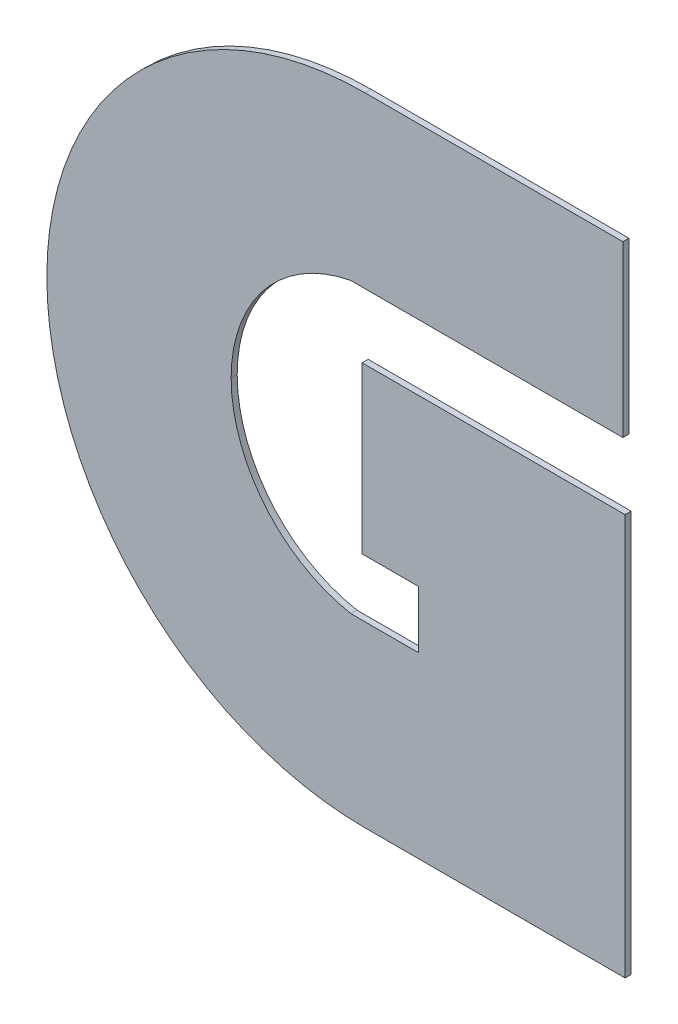
ISO-10303-21;
HEADER;
FILE_DESCRIPTION(('STEP AP214'),'2;1');
FILE_NAME('part.step','',(''),(''),'','','');
FILE_SCHEMA(('AUTOMOTIVE_DESIGN { 1 0 10303 214 1 1 1 1 }'));
ENDSEC;
DATA;
#1=APPLICATION_CONTEXT('core data for automotive mechanical design processes');
#2=APPLICATION_PROTOCOL_DEFINITION('international standard','automotive_design',2000,#1);
#3=PRODUCT_CONTEXT('',#1,'mechanical');
#4=PRODUCT('Part','Part','',(#3));
#5=PRODUCT_RELATED_PRODUCT_CATEGORY('part','',(#4));
#6=PRODUCT_DEFINITION_FORMATION('','',#4);
#7=PRODUCT_DEFINITION_CONTEXT('part definition',#1,'design');
#8=PRODUCT_DEFINITION('design','',#6,#7);
#9=PRODUCT_DEFINITION_SHAPE('','',#8);
#10=(LENGTH_UNIT() NAMED_UNIT(*) SI_UNIT(.MILLI.,.METRE.));
#11=(NAMED_UNIT(*) PLANE_ANGLE_UNIT() SI_UNIT($,.RADIAN.));
#12=(NAMED_UNIT(*) SI_UNIT($,.STERADIAN.) SOLID_ANGLE_UNIT());
#13=UNCERTAINTY_MEASURE_WITH_UNIT(LENGTH_MEASURE(1.E-05),#10,'distance_accuracy_value','');
#14=(GEOMETRIC_REPRESENTATION_CONTEXT(3) GLOBAL_UNCERTAINTY_ASSIGNED_CONTEXT((#13)) GLOBAL_UNIT_ASSIGNED_CONTEXT((#10,
#11,#12)) REPRESENTATION_CONTEXT('',''));
#15=CARTESIAN_POINT('',(0.,0.,0.));
#16=DIRECTION('',(0.,0.,1.));
#17=DIRECTION('',(1.,0.,0.));
#18=AXIS2_PLACEMENT_3D('',#15,#16,#17);
#19=CARTESIAN_POINT('',(1.17538503979784,1.09114402075406,0.551));
#20=DIRECTION('',(0.,0.,-1.));
#21=DIRECTION('',(-1.,0.,0.));
#22=AXIS2_PLACEMENT_3D('',#19,#20,#21);
#23=CYLINDRICAL_SURFACE('',#22,0.0242207838275586);
#24=CARTESIAN_POINT('',(1.17538503979784,1.09114402075406,0.551));
#25=DIRECTION('',(0.,0.,1.));
#26=DIRECTION('',(-0.184401724933551,0.982850957084303,0.));
#27=AXIS2_PLACEMENT_3D('',#24,#25,#26);
#28=CIRCLE('',#27,0.0242207838275586);
#29=CARTESIAN_POINT('',(1.1709186854808,1.11494944132031,0.551));
#30=VERTEX_POINT('',#29);
#31=CARTESIAN_POINT('',(1.15116425597028,1.09114402075406,0.551));
#32=VERTEX_POINT('',#31);
#33=EDGE_CURVE('E11',#30,#32,#28,.T.);
#34=ORIENTED_EDGE('',*,*,#33,.T.);
#35=DIRECTION('',(0.,0.,-1.));
#36=VECTOR('',#35,1.);
#37=CARTESIAN_POINT('',(1.15116425597028,1.09114402075406,0.551));
#38=LINE('',#37,#36);
#39=CARTESIAN_POINT('',(1.15116425597028,1.09114402075406,0.55));
#40=VERTEX_POINT('',#39);
#41=EDGE_CURVE('E232',#32,#40,#38,.T.);
#42=ORIENTED_EDGE('',*,*,#41,.T.);
#43=CARTESIAN_POINT('',(1.17538503979784,1.09114402075406,0.55));
#44=DIRECTION('',(0.,0.,1.));
#45=DIRECTION('',(-0.184401724933551,0.982850957084303,0.));
#46=AXIS2_PLACEMENT_3D('',#43,#44,#45);
#47=CIRCLE('',#46,0.0242207838275586);
#48=CARTESIAN_POINT('',(1.1709186854808,1.11494944132031,0.55));
#49=VERTEX_POINT('',#48);
#50=EDGE_CURVE('E225',#49,#40,#47,.T.);
#51=ORIENTED_EDGE('',*,*,#50,.F.);
#52=DIRECTION('',(0.,-2.22044604925006E-13,-1.));
#53=VECTOR('',#52,1.);
#54=CARTESIAN_POINT('',(1.1709186854808,1.11494944132031,0.551));
#55=LINE('',#54,#53);
#56=EDGE_CURVE('E218',#30,#49,#55,.T.);
#57=ORIENTED_EDGE('',*,*,#56,.F.);
#58=EDGE_LOOP('',(#34,#42,#51,#57));
#59=FACE_BOUND('',#58,.T.);
#60=ADVANCED_FACE('F17',(#59),#23,.F.);
#61=CARTESIAN_POINT('',(1.17328449263257,1.09041837001827,0.551));
#62=DIRECTION('',(0.,0.,-1.));
#63=DIRECTION('',(-1.,0.,0.));
#64=AXIS2_PLACEMENT_3D('',#61,#62,#63);
#65=CYLINDRICAL_SURFACE('',#64,0.0525335868072115);
#66=CARTESIAN_POINT('',(1.17328449263257,1.09041837001827,0.551));
#67=DIRECTION('',(0.,0.,1.));
#68=DIRECTION('',(-1.,0.,0.));
#69=AXIS2_PLACEMENT_3D('',#66,#67,#68);
#70=CIRCLE('',#69,0.0525335868072115);
#71=CARTESIAN_POINT('',(1.12075090582536,1.09041837001827,0.551));
#72=VERTEX_POINT('',#71);
#73=CARTESIAN_POINT('',(1.17328449263257,1.03788478321106,0.551));
#74=VERTEX_POINT('',#73);
#75=EDGE_CURVE('E24',#72,#74,#70,.T.);
#76=ORIENTED_EDGE('',*,*,#75,.F.);
#77=DIRECTION('',(0.,0.,-1.));
#78=VECTOR('',#77,1.);
#79=CARTESIAN_POINT('',(1.12075090582536,1.09041837001827,0.551));
#80=LINE('',#79,#78);
#81=CARTESIAN_POINT('',(1.12075090582536,1.09041837001827,0.55));
#82=VERTEX_POINT('',#81);
#83=EDGE_CURVE('E228',#72,#82,#80,.T.);
#84=ORIENTED_EDGE('',*,*,#83,.T.);
#85=CARTESIAN_POINT('',(1.17328449263257,1.09041837001827,0.55));
#86=DIRECTION('',(0.,0.,1.));
#87=DIRECTION('',(-1.,0.,0.));
#88=AXIS2_PLACEMENT_3D('',#85,#86,#87);
#89=CIRCLE('',#88,0.0525335868072115);
#90=CARTESIAN_POINT('',(1.17328449263257,1.03788478321106,0.55));
#91=VERTEX_POINT('',#90);
#92=EDGE_CURVE('E220',#82,#91,#89,.T.);
#93=ORIENTED_EDGE('',*,*,#92,.T.);
#94=DIRECTION('',(0.,0.,-1.));
#95=VECTOR('',#94,1.);
#96=CARTESIAN_POINT('',(1.17328449263257,1.03788478321106,0.551));
#97=LINE('',#96,#95);
#98=EDGE_CURVE('E208',#74,#91,#97,.T.);
#99=ORIENTED_EDGE('',*,*,#98,.F.);
#100=EDGE_LOOP('',(#76,#84,#93,#99));
#101=FACE_BOUND('',#100,.T.);
#102=ADVANCED_FACE('F240',(#101),#65,.T.);
#103=CARTESIAN_POINT('',(0.,1.14295195682548,0.551));
#104=DIRECTION('',(0.,-1.,0.));
#105=DIRECTION('',(0.,0.,-1.));
#106=AXIS2_PLACEMENT_3D('',#103,#104,#105);
#107=PLANE('',#106);
#108=DIRECTION('',(-1.,0.,0.));
#109=VECTOR('',#108,1.);
#110=CARTESIAN_POINT('',(1.21582066914557,1.14295195682548,0.55));
#111=LINE('',#110,#109);
#112=CARTESIAN_POINT('',(1.21582066914557,1.14295195682548,0.55));
#113=VERTEX_POINT('',#112);
#114=CARTESIAN_POINT('',(1.17328449263257,1.14295195682548,0.55));
#115=VERTEX_POINT('',#114);
#116=EDGE_CURVE('E230',#113,#115,#111,.T.);
#117=ORIENTED_EDGE('',*,*,#116,.T.);
#118=DIRECTION('',(0.,0.,-1.));
#119=VECTOR('',#118,1.);
#120=CARTESIAN_POINT('',(1.17328449263257,1.14295195682548,0.551));
#121=LINE('',#120,#119);
#122=CARTESIAN_POINT('',(1.17328449263257,1.14295195682548,0.551));
#123=VERTEX_POINT('',#122);
#124=EDGE_CURVE('E222',#123,#115,#121,.T.);
#125=ORIENTED_EDGE('',*,*,#124,.F.);
#126=DIRECTION('',(-1.,0.,0.));
#127=VECTOR('',#126,1.);
#128=CARTESIAN_POINT('',(1.21582066914557,1.14295195682548,0.551));
#129=LINE('',#128,#127);
#130=CARTESIAN_POINT('',(1.21582066914557,1.14295195682548,0.551));
#131=VERTEX_POINT('',#130);
#132=EDGE_CURVE('E211',#131,#123,#129,.T.);
#133=ORIENTED_EDGE('',*,*,#132,.F.);
#134=DIRECTION('',(0.,0.,-1.));
#135=VECTOR('',#134,1.);
#136=CARTESIAN_POINT('',(1.21582066914557,1.14295195682548,0.551));
#137=LINE('',#136,#135);
#138=EDGE_CURVE('E131',#131,#113,#137,.T.);
#139=ORIENTED_EDGE('',*,*,#138,.T.);
#140=EDGE_LOOP('',(#117,#125,#133,#139));
#141=FACE_BOUND('',#140,.T.);
#142=ADVANCED_FACE('F271',(#141),#107,.F.);
#143=CARTESIAN_POINT('',(1.17328449263257,1.09041837001827,0.551));
#144=DIRECTION('',(0.,0.,-1.));
#145=DIRECTION('',(-1.,0.,0.));
#146=AXIS2_PLACEMENT_3D('',#143,#144,#145);
#147=CYLINDRICAL_SURFACE('',#146,0.0525335868072115);
#148=ORIENTED_EDGE('',*,*,#83,.F.);
#149=CARTESIAN_POINT('',(1.17328449263257,1.09041837001827,0.551));
#150=DIRECTION('',(0.,0.,1.));
#151=DIRECTION('',(0.,1.,0.));
#152=AXIS2_PLACEMENT_3D('',#149,#150,#151);
#153=CIRCLE('',#152,0.0525335868072115);
#154=EDGE_CURVE('E213',#123,#72,#153,.T.);
#155=ORIENTED_EDGE('',*,*,#154,.F.);
#156=ORIENTED_EDGE('',*,*,#124,.T.);
#157=CARTESIAN_POINT('',(1.17328449263257,1.09041837001827,0.55));
#158=DIRECTION('',(0.,0.,1.));
#159=DIRECTION('',(0.,1.,0.));
#160=AXIS2_PLACEMENT_3D('',#157,#158,#159);
#161=CIRCLE('',#160,0.0525335868072115);
#162=EDGE_CURVE('E189',#115,#82,#161,.T.);
#163=ORIENTED_EDGE('',*,*,#162,.T.);
#164=EDGE_LOOP('',(#148,#155,#156,#163));
#165=FACE_BOUND('',#164,.T.);
#166=ADVANCED_FACE('F237',(#165),#147,.T.);
#167=CARTESIAN_POINT('',(0.,1.03788478321106,0.551));
#168=DIRECTION('',(0.,1.,0.));
#169=DIRECTION('',(0.,0.,1.));
#170=AXIS2_PLACEMENT_3D('',#167,#168,#169);
#171=PLANE('',#170);
#172=DIRECTION('',(1.,0.,0.));
#173=VECTOR('',#172,1.);
#174=CARTESIAN_POINT('',(1.17328449263257,1.03788478321106,0.55));
#175=LINE('',#174,#173);
#176=CARTESIAN_POINT('',(1.2161854235625,1.03788478321106,0.55));
#177=VERTEX_POINT('',#176);
#178=EDGE_CURVE('E216',#91,#177,#175,.T.);
#179=ORIENTED_EDGE('',*,*,#178,.T.);
#180=DIRECTION('',(-2.22044604925006E-13,0.,-1.));
#181=VECTOR('',#180,1.);
#182=CARTESIAN_POINT('',(1.2161854235625,1.03788478321106,0.551));
#183=LINE('',#182,#181);
#184=CARTESIAN_POINT('',(1.2161854235625,1.03788478321106,0.551));
#185=VERTEX_POINT('',#184);
#186=EDGE_CURVE('E202',#185,#177,#183,.T.);
#187=ORIENTED_EDGE('',*,*,#186,.F.);
#188=DIRECTION('',(1.,0.,0.));
#189=VECTOR('',#188,1.);
#190=CARTESIAN_POINT('',(1.17328449263257,1.03788478321106,0.551));
#191=LINE('',#190,#189);
#192=EDGE_CURVE('E192',#74,#185,#191,.T.);
#193=ORIENTED_EDGE('',*,*,#192,.F.);
#194=ORIENTED_EDGE('',*,*,#98,.T.);
#195=EDGE_LOOP('',(#179,#187,#193,#194));
#196=FACE_BOUND('',#195,.T.);
#197=ADVANCED_FACE('F244',(#196),#171,.F.);
#198=CARTESIAN_POINT('',(1.2161854235625,0.,0.551));
#199=DIRECTION('',(1.,0.,0.));
#200=DIRECTION('',(0.,0.,-1.));
#201=AXIS2_PLACEMENT_3D('',#198,#199,#200);
#202=PLANE('',#201);
#203=DIRECTION('',(0.,-1.,0.));
#204=VECTOR('',#203,1.);
#205=CARTESIAN_POINT('',(1.2161854235625,1.10411735782392,0.55));
#206=LINE('',#205,#204);
#207=CARTESIAN_POINT('',(1.2161854235625,1.10411735782392,0.55));
#208=VERTEX_POINT('',#207);
#209=EDGE_CURVE('E205',#208,#177,#206,.T.);
#210=ORIENTED_EDGE('',*,*,#209,.F.);
#211=DIRECTION('',(-2.22044604925006E-13,0.,-1.));
#212=VECTOR('',#211,1.);
#213=CARTESIAN_POINT('',(1.2161854235625,1.10411735782392,0.551));
#214=LINE('',#213,#212);
#215=CARTESIAN_POINT('',(1.2161854235625,1.10411735782392,0.551));
#216=VERTEX_POINT('',#215);
#217=EDGE_CURVE('E195',#216,#208,#214,.T.);
#218=ORIENTED_EDGE('',*,*,#217,.F.);
#219=DIRECTION('',(0.,-1.,0.));
#220=VECTOR('',#219,1.);
#221=CARTESIAN_POINT('',(1.2161854235625,1.10411735782392,0.551));
#222=LINE('',#221,#220);
#223=EDGE_CURVE('E180',#216,#185,#222,.T.);
#224=ORIENTED_EDGE('',*,*,#223,.T.);
#225=ORIENTED_EDGE('',*,*,#186,.T.);
#226=EDGE_LOOP('',(#210,#218,#224,#225));
#227=FACE_BOUND('',#226,.T.);
#228=ADVANCED_FACE('F248',(#227),#202,.T.);
#229=CARTESIAN_POINT('',(0.,1.10411735782392,0.551));
#230=DIRECTION('',(0.,1.,0.));
#231=DIRECTION('',(0.,0.,1.));
#232=AXIS2_PLACEMENT_3D('',#229,#230,#231);
#233=PLANE('',#232);
#234=DIRECTION('',(1.,0.,0.));
#235=VECTOR('',#234,1.);
#236=CARTESIAN_POINT('',(1.17278335833392,1.10411735782392,0.55));
#237=LINE('',#236,#235);
#238=CARTESIAN_POINT('',(1.17278335833392,1.10411735782392,0.55));
#239=VERTEX_POINT('',#238);
#240=EDGE_CURVE('E198',#239,#208,#237,.T.);
#241=ORIENTED_EDGE('',*,*,#240,.F.);
#242=DIRECTION('',(0.,0.,-1.));
#243=VECTOR('',#242,1.);
#244=CARTESIAN_POINT('',(1.17278335833392,1.10411735782392,0.551));
#245=LINE('',#244,#243);
#246=CARTESIAN_POINT('',(1.17278335833392,1.10411735782392,0.551));
#247=VERTEX_POINT('',#246);
#248=EDGE_CURVE('E183',#247,#239,#245,.T.);
#249=ORIENTED_EDGE('',*,*,#248,.F.);
#250=DIRECTION('',(1.,0.,0.));
#251=VECTOR('',#250,1.);
#252=CARTESIAN_POINT('',(1.17278335833392,1.10411735782392,0.551));
#253=LINE('',#252,#251);
#254=EDGE_CURVE('E172',#247,#216,#253,.T.);
#255=ORIENTED_EDGE('',*,*,#254,.T.);
#256=ORIENTED_EDGE('',*,*,#217,.T.);
#257=EDGE_LOOP('',(#241,#249,#255,#256));
#258=FACE_BOUND('',#257,.T.);
#259=ADVANCED_FACE('F250',(#258),#233,.T.);
#260=CARTESIAN_POINT('',(1.17278335833392,0.,0.551));
#261=DIRECTION('',(-1.,0.,0.));
#262=DIRECTION('',(0.,0.,1.));
#263=AXIS2_PLACEMENT_3D('',#260,#261,#262);
#264=PLANE('',#263);
#265=DIRECTION('',(0.,1.,0.));
#266=VECTOR('',#265,1.);
#267=CARTESIAN_POINT('',(1.17278335833392,1.07680540082672,0.55));
#268=LINE('',#267,#266);
#269=CARTESIAN_POINT('',(1.17278335833392,1.07680540082672,0.55));
#270=VERTEX_POINT('',#269);
#271=EDGE_CURVE('E186',#270,#239,#268,.T.);
#272=ORIENTED_EDGE('',*,*,#271,.F.);
#273=DIRECTION('',(0.,0.,-1.));
#274=VECTOR('',#273,1.);
#275=CARTESIAN_POINT('',(1.17278335833392,1.07680540082672,0.551));
#276=LINE('',#275,#274);
#277=CARTESIAN_POINT('',(1.17278335833392,1.07680540082672,0.551));
#278=VERTEX_POINT('',#277);
#279=EDGE_CURVE('E175',#278,#270,#276,.T.);
#280=ORIENTED_EDGE('',*,*,#279,.F.);
#281=DIRECTION('',(0.,1.,0.));
#282=VECTOR('',#281,1.);
#283=CARTESIAN_POINT('',(1.17278335833392,1.07680540082672,0.551));
#284=LINE('',#283,#282);
#285=EDGE_CURVE('E164',#278,#247,#284,.T.);
#286=ORIENTED_EDGE('',*,*,#285,.T.);
#287=ORIENTED_EDGE('',*,*,#248,.T.);
#288=EDGE_LOOP('',(#272,#280,#286,#287));
#289=FACE_BOUND('',#288,.T.);
#290=ADVANCED_FACE('F255',(#289),#264,.T.);
#291=CARTESIAN_POINT('',(0.,1.07680540082672,0.551));
#292=DIRECTION('',(0.,1.,0.));
#293=DIRECTION('',(0.,0.,1.));
#294=AXIS2_PLACEMENT_3D('',#291,#292,#293);
#295=PLANE('',#294);
#296=DIRECTION('',(1.,0.,0.));
#297=VECTOR('',#296,1.);
#298=CARTESIAN_POINT('',(1.17278335833392,1.07680540082672,0.55));
#299=LINE('',#298,#297);
#300=CARTESIAN_POINT('',(1.18210672259951,1.07680540082672,0.55));
#301=VERTEX_POINT('',#300);
#302=EDGE_CURVE('E178',#270,#301,#299,.T.);
#303=ORIENTED_EDGE('',*,*,#302,.T.);
#304=DIRECTION('',(-2.22044604925006E-13,0.,-1.));
#305=VECTOR('',#304,1.);
#306=CARTESIAN_POINT('',(1.18210672259951,1.07680540082672,0.551));
#307=LINE('',#306,#305);
#308=CARTESIAN_POINT('',(1.18210672259951,1.07680540082672,0.551));
#309=VERTEX_POINT('',#308);
#310=EDGE_CURVE('E167',#309,#301,#307,.T.);
#311=ORIENTED_EDGE('',*,*,#310,.F.);
#312=DIRECTION('',(1.,0.,0.));
#313=VECTOR('',#312,1.);
#314=CARTESIAN_POINT('',(1.17278335833392,1.07680540082672,0.551));
#315=LINE('',#314,#313);
#316=EDGE_CURVE('E156',#278,#309,#315,.T.);
#317=ORIENTED_EDGE('',*,*,#316,.F.);
#318=ORIENTED_EDGE('',*,*,#279,.T.);
#319=EDGE_LOOP('',(#303,#311,#317,#318));
#320=FACE_BOUND('',#319,.T.);
#321=ADVANCED_FACE('F258',(#320),#295,.F.);
#322=CARTESIAN_POINT('',(1.18210672259951,0.,0.551));
#323=DIRECTION('',(1.,0.,0.));
#324=DIRECTION('',(0.,0.,-1.));
#325=AXIS2_PLACEMENT_3D('',#322,#323,#324);
#326=PLANE('',#325);
#327=DIRECTION('',(0.,-1.,0.));
#328=VECTOR('',#327,1.);
#329=CARTESIAN_POINT('',(1.18210672259951,1.07680540082672,0.55));
#330=LINE('',#329,#328);
#331=CARTESIAN_POINT('',(1.18210672259951,1.06733860018782,0.55));
#332=VERTEX_POINT('',#331);
#333=EDGE_CURVE('E170',#301,#332,#330,.T.);
#334=ORIENTED_EDGE('',*,*,#333,.T.);
#335=DIRECTION('',(-2.22044604925006E-13,0.,-1.));
#336=VECTOR('',#335,1.);
#337=CARTESIAN_POINT('',(1.18210672259951,1.06733860018782,0.551));
#338=LINE('',#337,#336);
#339=CARTESIAN_POINT('',(1.18210672259951,1.06733860018782,0.551));
#340=VERTEX_POINT('',#339);
#341=EDGE_CURVE('E159',#340,#332,#338,.T.);
#342=ORIENTED_EDGE('',*,*,#341,.F.);
#343=DIRECTION('',(0.,-1.,0.));
#344=VECTOR('',#343,1.);
#345=CARTESIAN_POINT('',(1.18210672259951,1.07680540082672,0.551));
#346=LINE('',#345,#344);
#347=EDGE_CURVE('E150',#309,#340,#346,.T.);
#348=ORIENTED_EDGE('',*,*,#347,.F.);
#349=ORIENTED_EDGE('',*,*,#310,.T.);
#350=EDGE_LOOP('',(#334,#342,#348,#349));
#351=FACE_BOUND('',#350,.T.);
#352=ADVANCED_FACE('F262',(#351),#326,.F.);
#353=CARTESIAN_POINT('',(0.,1.06733860018782,0.551));
#354=DIRECTION('',(0.,-1.,0.));
#355=DIRECTION('',(0.,0.,-1.));
#356=AXIS2_PLACEMENT_3D('',#353,#354,#355);
#357=PLANE('',#356);
#358=DIRECTION('',(-1.,0.,0.));
#359=VECTOR('',#358,1.);
#360=CARTESIAN_POINT('',(1.18210672259951,1.06733860018782,0.55));
#361=LINE('',#360,#359);
#362=CARTESIAN_POINT('',(1.1709186854808,1.06733860018782,0.55));
#363=VERTEX_POINT('',#362);
#364=EDGE_CURVE('E162',#332,#363,#361,.T.);
#365=ORIENTED_EDGE('',*,*,#364,.T.);
#366=DIRECTION('',(0.,0.,-1.));
#367=VECTOR('',#366,1.);
#368=CARTESIAN_POINT('',(1.1709186854808,1.06733860018782,0.551));
#369=LINE('',#368,#367);
#370=CARTESIAN_POINT('',(1.1709186854808,1.06733860018782,0.551));
#371=VERTEX_POINT('',#370);
#372=EDGE_CURVE('E153',#371,#363,#369,.T.);
#373=ORIENTED_EDGE('',*,*,#372,.F.);
#374=DIRECTION('',(-1.,0.,0.));
#375=VECTOR('',#374,1.);
#376=CARTESIAN_POINT('',(1.18210672259951,1.06733860018782,0.551));
#377=LINE('',#376,#375);
#378=EDGE_CURVE('E143',#340,#371,#377,.T.);
#379=ORIENTED_EDGE('',*,*,#378,.F.);
#380=ORIENTED_EDGE('',*,*,#341,.T.);
#381=EDGE_LOOP('',(#365,#373,#379,#380));
#382=FACE_BOUND('',#381,.T.);
#383=ADVANCED_FACE('F265',(#382),#357,.F.);
#384=CARTESIAN_POINT('',(1.17538503979784,1.09114402075406,0.551));
#385=DIRECTION('',(0.,0.,-1.));
#386=DIRECTION('',(-1.,0.,0.));
#387=AXIS2_PLACEMENT_3D('',#384,#385,#386);
#388=CYLINDRICAL_SURFACE('',#387,0.0242207838275586);
#389=ORIENTED_EDGE('',*,*,#41,.F.);
#390=CARTESIAN_POINT('',(1.17538503979784,1.09114402075406,0.551));
#391=DIRECTION('',(0.,0.,1.));
#392=DIRECTION('',(-1.,0.,0.));
#393=AXIS2_PLACEMENT_3D('',#390,#391,#392);
#394=CIRCLE('',#393,0.0242207838275586);
#395=EDGE_CURVE('E146',#32,#371,#394,.T.);
#396=ORIENTED_EDGE('',*,*,#395,.T.);
#397=ORIENTED_EDGE('',*,*,#372,.T.);
#398=CARTESIAN_POINT('',(1.17538503979784,1.09114402075406,0.55));
#399=DIRECTION('',(0.,0.,1.));
#400=DIRECTION('',(-1.,0.,0.));
#401=AXIS2_PLACEMENT_3D('',#398,#399,#400);
#402=CIRCLE('',#401,0.0242207838275586);
#403=EDGE_CURVE('E134',#40,#363,#402,.T.);
#404=ORIENTED_EDGE('',*,*,#403,.F.);
#405=EDGE_LOOP('',(#389,#396,#397,#404));
#406=FACE_BOUND('',#405,.T.);
#407=ADVANCED_FACE('F269',(#406),#388,.F.);
#408=CARTESIAN_POINT('',(0.,1.11494944132031,0.551));
#409=DIRECTION('',(0.,1.,0.));
#410=DIRECTION('',(0.,0.,1.));
#411=AXIS2_PLACEMENT_3D('',#408,#409,#410);
#412=PLANE('',#411);
#413=DIRECTION('',(1.,0.,0.));
#414=VECTOR('',#413,1.);
#415=CARTESIAN_POINT('',(1.1709186854808,1.11494944132031,0.55));
#416=LINE('',#415,#414);
#417=CARTESIAN_POINT('',(1.21582066914557,1.11494944132031,0.55));
#418=VERTEX_POINT('',#417);
#419=EDGE_CURVE('E121',#49,#418,#416,.T.);
#420=ORIENTED_EDGE('',*,*,#419,.T.);
#421=DIRECTION('',(0.,-2.22044604925006E-13,-1.));
#422=VECTOR('',#421,1.);
#423=CARTESIAN_POINT('',(1.21582066914557,1.11494944132031,0.551));
#424=LINE('',#423,#422);
#425=CARTESIAN_POINT('',(1.21582066914557,1.11494944132031,0.551));
#426=VERTEX_POINT('',#425);
#427=EDGE_CURVE('E114',#426,#418,#424,.T.);
#428=ORIENTED_EDGE('',*,*,#427,.F.);
#429=DIRECTION('',(1.,0.,0.));
#430=VECTOR('',#429,1.);
#431=CARTESIAN_POINT('',(1.1709186854808,1.11494944132031,0.551));
#432=LINE('',#431,#430);
#433=EDGE_CURVE('E119',#30,#426,#432,.T.);
#434=ORIENTED_EDGE('',*,*,#433,.F.);
#435=ORIENTED_EDGE('',*,*,#56,.T.);
#436=EDGE_LOOP('',(#420,#428,#434,#435));
#437=FACE_BOUND('',#436,.T.);
#438=ADVANCED_FACE('F116',(#437),#412,.F.);
#439=CARTESIAN_POINT('',(1.21582066914557,0.,0.551));
#440=DIRECTION('',(-1.,0.,0.));
#441=DIRECTION('',(0.,0.,1.));
#442=AXIS2_PLACEMENT_3D('',#439,#440,#441);
#443=PLANE('',#442);
#444=DIRECTION('',(0.,1.,0.));
#445=VECTOR('',#444,1.);
#446=CARTESIAN_POINT('',(1.21582066914557,1.11494944132031,0.55));
#447=LINE('',#446,#445);
#448=EDGE_CURVE('E125',#418,#113,#447,.T.);
#449=ORIENTED_EDGE('',*,*,#448,.T.);
#450=ORIENTED_EDGE('',*,*,#138,.F.);
#451=DIRECTION('',(0.,1.,0.));
#452=VECTOR('',#451,1.);
#453=CARTESIAN_POINT('',(1.21582066914557,1.11494944132031,0.551));
#454=LINE('',#453,#452);
#455=EDGE_CURVE('E129',#426,#131,#454,.T.);
#456=ORIENTED_EDGE('',*,*,#455,.F.);
#457=ORIENTED_EDGE('',*,*,#427,.T.);
#458=EDGE_LOOP('',(#449,#450,#456,#457));
#459=FACE_BOUND('',#458,.T.);
#460=ADVANCED_FACE('F130',(#459),#443,.F.);
#461=CARTESIAN_POINT('',(0.,0.,0.551));
#462=DIRECTION('',(0.,0.,1.));
#463=DIRECTION('',(1.,0.,0.));
#464=AXIS2_PLACEMENT_3D('',#461,#462,#463);
#465=PLANE('',#464);
#466=ORIENTED_EDGE('',*,*,#132,.T.);
#467=ORIENTED_EDGE('',*,*,#154,.T.);
#468=ORIENTED_EDGE('',*,*,#75,.T.);
#469=ORIENTED_EDGE('',*,*,#192,.T.);
#470=ORIENTED_EDGE('',*,*,#223,.F.);
#471=ORIENTED_EDGE('',*,*,#254,.F.);
#472=ORIENTED_EDGE('',*,*,#285,.F.);
#473=ORIENTED_EDGE('',*,*,#316,.T.);
#474=ORIENTED_EDGE('',*,*,#347,.T.);
#475=ORIENTED_EDGE('',*,*,#378,.T.);
#476=ORIENTED_EDGE('',*,*,#395,.F.);
#477=ORIENTED_EDGE('',*,*,#33,.F.);
#478=ORIENTED_EDGE('',*,*,#433,.T.);
#479=ORIENTED_EDGE('',*,*,#455,.T.);
#480=EDGE_LOOP('',(#466,#467,#468,#469,#470,#471,#472,#473,#474,#475,#476,#477,#478,#479));
#481=FACE_BOUND('',#480,.T.);
#482=ADVANCED_FACE('F136',(#481),#465,.T.);
#483=CARTESIAN_POINT('',(0.,0.,0.55));
#484=DIRECTION('',(0.,0.,1.));
#485=DIRECTION('',(1.,0.,0.));
#486=AXIS2_PLACEMENT_3D('',#483,#484,#485);
#487=PLANE('',#486);
#488=ORIENTED_EDGE('',*,*,#116,.F.);
#489=ORIENTED_EDGE('',*,*,#448,.F.);
#490=ORIENTED_EDGE('',*,*,#419,.F.);
#491=ORIENTED_EDGE('',*,*,#50,.T.);
#492=ORIENTED_EDGE('',*,*,#403,.T.);
#493=ORIENTED_EDGE('',*,*,#364,.F.);
#494=ORIENTED_EDGE('',*,*,#333,.F.);
#495=ORIENTED_EDGE('',*,*,#302,.F.);
#496=ORIENTED_EDGE('',*,*,#271,.T.);
#497=ORIENTED_EDGE('',*,*,#240,.T.);
#498=ORIENTED_EDGE('',*,*,#209,.T.);
#499=ORIENTED_EDGE('',*,*,#178,.F.);
#500=ORIENTED_EDGE('',*,*,#92,.F.);
#501=ORIENTED_EDGE('',*,*,#162,.F.);
#502=EDGE_LOOP('',(#488,#489,#490,#491,#492,#493,#494,#495,#496,#497,#498,#499,#500,#501));
#503=FACE_BOUND('',#502,.T.);
#504=ADVANCED_FACE('F246',(#503),#487,.F.);
#505=CLOSED_SHELL('',(#60,#102,#142,#166,#197,#228,#259,#290,#321,#352,#383,#407,#438,#460,#482,#504));
#506=MANIFOLD_SOLID_BREP('B1',#505);
#507=ADVANCED_BREP_SHAPE_REPRESENTATION('',(#18,#506),#14);
#508=SHAPE_DEFINITION_REPRESENTATION(#9,#507);
ENDSEC;
END-ISO-10303-21;
